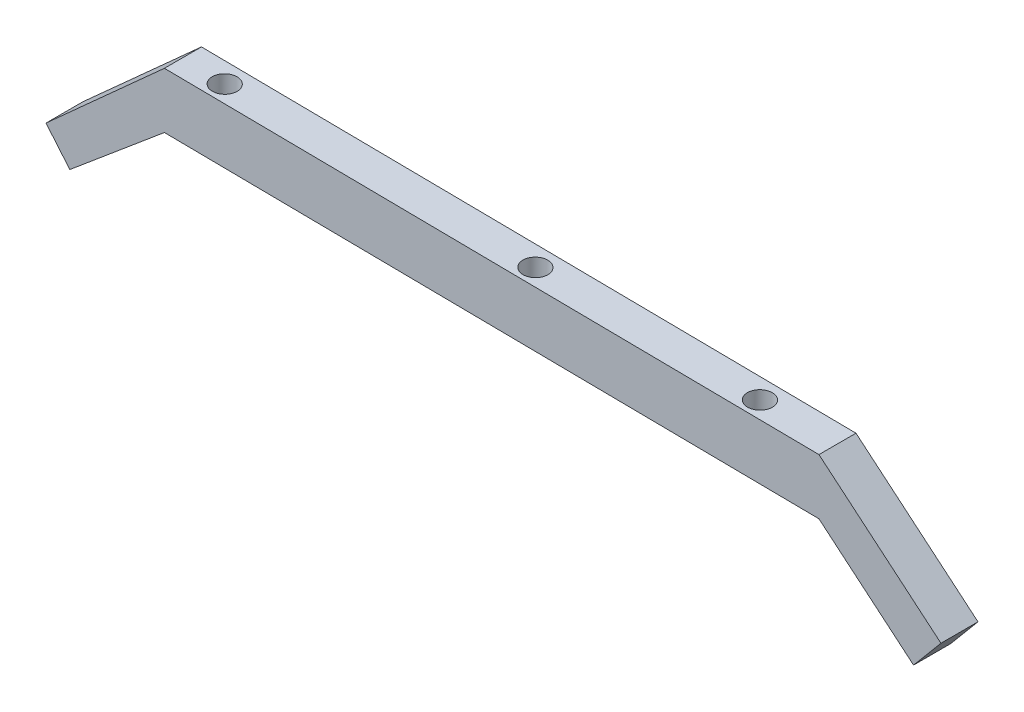
ISO-10303-21;
HEADER;
FILE_DESCRIPTION(('STEP AP214'),'2;1');
FILE_NAME('part.step','',(''),(''),'','','');
FILE_SCHEMA(('AUTOMOTIVE_DESIGN { 1 0 10303 214 1 1 1 1 }'));
ENDSEC;
DATA;
#1=APPLICATION_CONTEXT('core data for automotive mechanical design processes');
#2=APPLICATION_PROTOCOL_DEFINITION('international standard','automotive_design',2000,#1);
#3=PRODUCT_CONTEXT('',#1,'mechanical');
#4=PRODUCT('Part','Part','',(#3));
#5=PRODUCT_RELATED_PRODUCT_CATEGORY('part','',(#4));
#6=PRODUCT_DEFINITION_FORMATION('','',#4);
#7=PRODUCT_DEFINITION_CONTEXT('part definition',#1,'design');
#8=PRODUCT_DEFINITION('design','',#6,#7);
#9=PRODUCT_DEFINITION_SHAPE('','',#8);
#10=(LENGTH_UNIT() NAMED_UNIT(*) SI_UNIT(.MILLI.,.METRE.));
#11=(NAMED_UNIT(*) PLANE_ANGLE_UNIT() SI_UNIT($,.RADIAN.));
#12=(NAMED_UNIT(*) SI_UNIT($,.STERADIAN.) SOLID_ANGLE_UNIT());
#13=UNCERTAINTY_MEASURE_WITH_UNIT(LENGTH_MEASURE(1.E-05),#10,'distance_accuracy_value','');
#14=(GEOMETRIC_REPRESENTATION_CONTEXT(3) GLOBAL_UNCERTAINTY_ASSIGNED_CONTEXT((#13)) GLOBAL_UNIT_ASSIGNED_CONTEXT((#10,
#11,#12)) REPRESENTATION_CONTEXT('',''));
#15=CARTESIAN_POINT('',(0.,0.,0.));
#16=DIRECTION('',(0.,0.,1.));
#17=DIRECTION('',(1.,0.,0.));
#18=AXIS2_PLACEMENT_3D('',#15,#16,#17);
#19=CARTESIAN_POINT('',(-57.2334537938202,-0.0976513037543366,6.));
#20=DIRECTION('',(-0.642787609686535,0.766044443118982,0.));
#21=DIRECTION('',(-0.766044443118982,-0.642787609686535,0.));
#22=AXIS2_PLACEMENT_3D('',#19,#20,#21);
#23=PLANE('',#22);
#24=DIRECTION('',(0.766044443118982,0.642787609686535,0.));
#25=VECTOR('',#24,1.);
#26=CARTESIAN_POINT('',(-57.2334537938202,-0.0976513037543366,0.));
#27=LINE('',#26,#25);
#28=CARTESIAN_POINT('',(-72.5543426561998,-12.953403497485,0.));
#29=VERTEX_POINT('',#28);
#30=CARTESIAN_POINT('',(-57.2334537938202,-0.0976513037543366,0.));
#31=VERTEX_POINT('',#30);
#32=EDGE_CURVE('E140',#29,#31,#27,.T.);
#33=ORIENTED_EDGE('',*,*,#32,.T.);
#34=DIRECTION('',(0.,0.,-1.));
#35=VECTOR('',#34,1.);
#36=CARTESIAN_POINT('',(-57.2334537938202,-0.0976513037543366,6.));
#37=LINE('',#36,#35);
#38=CARTESIAN_POINT('',(-57.2334537938202,-0.0976513037543366,6.));
#39=VERTEX_POINT('',#38);
#40=EDGE_CURVE('E11',#39,#31,#37,.T.);
#41=ORIENTED_EDGE('',*,*,#40,.F.);
#42=DIRECTION('',(0.766044443118982,0.642787609686535,0.));
#43=VECTOR('',#42,1.);
#44=CARTESIAN_POINT('',(-57.2334537938202,-0.0976513037543366,6.));
#45=LINE('',#44,#43);
#46=CARTESIAN_POINT('',(-72.5543426561998,-12.953403497485,6.));
#47=VERTEX_POINT('',#46);
#48=EDGE_CURVE('E163',#47,#39,#45,.T.);
#49=ORIENTED_EDGE('',*,*,#48,.F.);
#50=DIRECTION('',(0.,0.,-1.));
#51=VECTOR('',#50,1.);
#52=CARTESIAN_POINT('',(-72.5543426561998,-12.953403497485,6.));
#53=LINE('',#52,#51);
#54=EDGE_CURVE('E136',#47,#29,#53,.T.);
#55=ORIENTED_EDGE('',*,*,#54,.T.);
#56=EDGE_LOOP('',(#33,#41,#49,#55));
#57=FACE_BOUND('',#56,.T.);
#58=ADVANCED_FACE('F39',(#57),#23,.F.);
#59=CARTESIAN_POINT('',(-57.2334537938202,-0.0976513037543366,6.));
#60=DIRECTION('',(0.0111065362275371,0.999938320524334,0.));
#61=DIRECTION('',(-0.999938320524335,0.0111065362275371,0.));
#62=AXIS2_PLACEMENT_3D('',#59,#60,#61);
#63=PLANE('',#62);
#64=CARTESIAN_POINT('',(-50.3211569221775,-0.174427714903513,3.2487874574399));
#65=DIRECTION('',(0.0111065362275371,0.999938320524334,0.));
#66=DIRECTION('',(-0.999938320524335,0.0111065362275371,0.));
#67=AXIS2_PLACEMENT_3D('',#64,#65,#66);
#68=CIRCLE('',#67,2.01708846596119);
#69=CARTESIAN_POINT('',(-52.3381209751798,-0.152024848782167,3.2487874574399));
#70=VERTEX_POINT('',#69);
#71=EDGE_CURVE('E145',#70,#70,#68,.T.);
#72=ORIENTED_EDGE('',*,*,#71,.T.);
#73=EDGE_LOOP('',(#72));
#74=FACE_BOUND('',#73,.T.);
#75=CARTESIAN_POINT('',(36.3606542700828,-1.13722177581173,3.2487874574399));
#76=DIRECTION('',(0.0111065362275371,0.999938320524334,0.));
#77=DIRECTION('',(-0.999938320524335,0.0111065362275371,0.));
#78=AXIS2_PLACEMENT_3D('',#75,#76,#77);
#79=CIRCLE('',#78,2.01708846596119);
#80=CARTESIAN_POINT('',(34.3436902170805,-1.11481890969039,3.2487874574399));
#81=VERTEX_POINT('',#80);
#82=EDGE_CURVE('E210',#81,#81,#79,.T.);
#83=ORIENTED_EDGE('',*,*,#82,.T.);
#84=EDGE_LOOP('',(#83));
#85=FACE_BOUND('',#84,.T.);
#86=CARTESIAN_POINT('',(-0.00814454195178721,-0.733265478441249,3.2487874574399));
#87=DIRECTION('',(0.0111065362275371,0.999938320524334,0.));
#88=DIRECTION('',(-0.999938320524335,0.0111065362275371,0.));
#89=AXIS2_PLACEMENT_3D('',#86,#87,#88);
#90=CIRCLE('',#89,2.01708846596119);
#91=CARTESIAN_POINT('',(-2.02510859495402,-0.710862612319903,3.2487874574399));
#92=VERTEX_POINT('',#91);
#93=EDGE_CURVE('E214',#92,#92,#90,.T.);
#94=ORIENTED_EDGE('',*,*,#93,.T.);
#95=EDGE_LOOP('',(#94));
#96=FACE_BOUND('',#95,.T.);
#97=DIRECTION('',(0.999938320524334,-0.0111065362275371,0.));
#98=VECTOR('',#97,1.);
#99=CARTESIAN_POINT('',(-57.2334537938202,-0.0976513037543366,0.));
#100=LINE('',#99,#98);
#101=CARTESIAN_POINT('',(48.7665462061798,-1.27501676315748,0.));
#102=VERTEX_POINT('',#101);
#103=EDGE_CURVE('E144',#31,#102,#100,.T.);
#104=ORIENTED_EDGE('',*,*,#103,.T.);
#105=DIRECTION('',(0.,0.,-1.));
#106=VECTOR('',#105,1.);
#107=CARTESIAN_POINT('',(48.7665462061798,-1.27501676315748,6.));
#108=LINE('',#107,#106);
#109=CARTESIAN_POINT('',(48.7665462061798,-1.27501676315748,6.));
#110=VERTEX_POINT('',#109);
#111=EDGE_CURVE('E48',#110,#102,#108,.T.);
#112=ORIENTED_EDGE('',*,*,#111,.F.);
#113=DIRECTION('',(0.999938320524334,-0.0111065362275371,0.));
#114=VECTOR('',#113,1.);
#115=CARTESIAN_POINT('',(-57.2334537938202,-0.0976513037543366,6.));
#116=LINE('',#115,#114);
#117=EDGE_CURVE('E99',#39,#110,#116,.T.);
#118=ORIENTED_EDGE('',*,*,#117,.F.);
#119=ORIENTED_EDGE('',*,*,#40,.T.);
#120=EDGE_LOOP('',(#104,#112,#118,#119));
#121=FACE_BOUND('',#120,.T.);
#122=ADVANCED_FACE('F246',(#74,#85,#96,#121),#63,.F.);
#123=CARTESIAN_POINT('',(48.7665462061798,-1.27501676315748,6.));
#124=DIRECTION('',(0.642787609686538,0.766044443118979,0.));
#125=DIRECTION('',(-0.766044443118979,0.642787609686538,0.));
#126=AXIS2_PLACEMENT_3D('',#123,#124,#125);
#127=PLANE('',#126);
#128=DIRECTION('',(0.766044443118979,-0.642787609686538,0.));
#129=VECTOR('',#128,1.);
#130=CARTESIAN_POINT('',(48.7665462061798,-1.27501676315748,0.));
#131=LINE('',#130,#129);
#132=CARTESIAN_POINT('',(64.0874350685594,-14.1307689568883,0.));
#133=VERTEX_POINT('',#132);
#134=EDGE_CURVE('E148',#102,#133,#131,.T.);
#135=ORIENTED_EDGE('',*,*,#134,.T.);
#136=DIRECTION('',(0.,0.,-1.));
#137=VECTOR('',#136,1.);
#138=CARTESIAN_POINT('',(64.0874350685594,-14.1307689568883,6.));
#139=LINE('',#138,#137);
#140=CARTESIAN_POINT('',(64.0874350685594,-14.1307689568883,6.));
#141=VERTEX_POINT('',#140);
#142=EDGE_CURVE('E174',#141,#133,#139,.T.);
#143=ORIENTED_EDGE('',*,*,#142,.F.);
#144=DIRECTION('',(0.766044443118979,-0.642787609686538,0.));
#145=VECTOR('',#144,1.);
#146=CARTESIAN_POINT('',(48.7665462061798,-1.27501676315748,6.));
#147=LINE('',#146,#145);
#148=EDGE_CURVE('E184',#110,#141,#147,.T.);
#149=ORIENTED_EDGE('',*,*,#148,.F.);
#150=ORIENTED_EDGE('',*,*,#111,.T.);
#151=EDGE_LOOP('',(#135,#143,#149,#150));
#152=FACE_BOUND('',#151,.T.);
#153=ADVANCED_FACE('F182',(#152),#127,.F.);
#154=CARTESIAN_POINT('',(64.0874350685594,-14.1307689568883,6.));
#155=DIRECTION('',(-0.766044443118979,0.642787609686538,0.));
#156=DIRECTION('',(-0.642787609686538,-0.766044443118979,0.));
#157=AXIS2_PLACEMENT_3D('',#154,#155,#156);
#158=PLANE('',#157);
#159=DIRECTION('',(0.642787609686538,0.766044443118979,0.));
#160=VECTOR('',#159,1.);
#161=CARTESIAN_POINT('',(64.0874350685594,-14.1307689568883,0.));
#162=LINE('',#161,#160);
#163=CARTESIAN_POINT('',(68.5239000429531,-8.84359588523619,0.));
#164=VERTEX_POINT('',#163);
#165=EDGE_CURVE('E151',#133,#164,#162,.T.);
#166=ORIENTED_EDGE('',*,*,#165,.T.);
#167=DIRECTION('',(0.,0.,-1.));
#168=VECTOR('',#167,1.);
#169=CARTESIAN_POINT('',(68.5239000429531,-8.84359588523619,6.));
#170=LINE('',#169,#168);
#171=CARTESIAN_POINT('',(68.5239000429531,-8.84359588523619,6.));
#172=VERTEX_POINT('',#171);
#173=EDGE_CURVE('E170',#172,#164,#170,.T.);
#174=ORIENTED_EDGE('',*,*,#173,.F.);
#175=DIRECTION('',(0.642787609686538,0.766044443118979,0.));
#176=VECTOR('',#175,1.);
#177=CARTESIAN_POINT('',(64.0874350685594,-14.1307689568883,6.));
#178=LINE('',#177,#176);
#179=EDGE_CURVE('E197',#141,#172,#178,.T.);
#180=ORIENTED_EDGE('',*,*,#179,.F.);
#181=ORIENTED_EDGE('',*,*,#142,.T.);
#182=EDGE_LOOP('',(#166,#174,#180,#181));
#183=FACE_BOUND('',#182,.T.);
#184=ADVANCED_FACE('F192',(#183),#158,.F.);
#185=CARTESIAN_POINT('',(48.7665462061798,7.73479243223928,6.));
#186=DIRECTION('',(-0.642787609686539,-0.766044443118978,0.));
#187=DIRECTION('',(0.766044443118978,-0.642787609686539,0.));
#188=AXIS2_PLACEMENT_3D('',#185,#186,#187);
#189=PLANE('',#188);
#190=DIRECTION('',(-0.766044443118978,0.642787609686539,0.));
#191=VECTOR('',#190,1.);
#192=CARTESIAN_POINT('',(48.7665462061798,7.73479243223928,0.));
#193=LINE('',#192,#191);
#194=CARTESIAN_POINT('',(48.7665462061798,7.73479243223928,0.));
#195=VERTEX_POINT('',#194);
#196=EDGE_CURVE('E154',#164,#195,#193,.T.);
#197=ORIENTED_EDGE('',*,*,#196,.T.);
#198=DIRECTION('',(0.,0.,-1.));
#199=VECTOR('',#198,1.);
#200=CARTESIAN_POINT('',(48.7665462061798,7.73479243223928,6.));
#201=LINE('',#200,#199);
#202=CARTESIAN_POINT('',(48.7665462061798,7.73479243223928,6.));
#203=VERTEX_POINT('',#202);
#204=EDGE_CURVE('E129',#203,#195,#201,.T.);
#205=ORIENTED_EDGE('',*,*,#204,.F.);
#206=DIRECTION('',(-0.766044443118978,0.642787609686539,0.));
#207=VECTOR('',#206,1.);
#208=CARTESIAN_POINT('',(48.7665462061798,7.73479243223928,6.));
#209=LINE('',#208,#207);
#210=EDGE_CURVE('E118',#172,#203,#209,.T.);
#211=ORIENTED_EDGE('',*,*,#210,.F.);
#212=ORIENTED_EDGE('',*,*,#173,.T.);
#213=EDGE_LOOP('',(#197,#205,#211,#212));
#214=FACE_BOUND('',#213,.T.);
#215=ADVANCED_FACE('F195',(#214),#189,.F.);
#216=CARTESIAN_POINT('',(-57.2334537938202,8.91215789164242,6.));
#217=DIRECTION('',(-0.0111065362275371,-0.999938320524334,0.));
#218=DIRECTION('',(0.999938320524335,-0.0111065362275371,0.));
#219=AXIS2_PLACEMENT_3D('',#216,#217,#218);
#220=PLANE('',#219);
#221=CARTESIAN_POINT('',(-50.2210953220734,8.83427007415574,3.2487874574399));
#222=DIRECTION('',(0.0111065362275371,0.999938320524334,0.));
#223=DIRECTION('',(-0.999938320524335,0.0111065362275371,0.));
#224=AXIS2_PLACEMENT_3D('',#221,#222,#223);
#225=CIRCLE('',#224,2.01708846596119);
#226=CARTESIAN_POINT('',(-52.2380593750756,8.85667294027708,3.2487874574399));
#227=VERTEX_POINT('',#226);
#228=EDGE_CURVE('E223',#227,#227,#225,.T.);
#229=ORIENTED_EDGE('',*,*,#228,.F.);
#230=EDGE_LOOP('',(#229));
#231=FACE_BOUND('',#230,.T.);
#232=CARTESIAN_POINT('',(36.4607158701869,7.87147601324752,3.2487874574399));
#233=DIRECTION('',(0.0111065362275371,0.999938320524334,0.));
#234=DIRECTION('',(-0.999938320524335,0.0111065362275371,0.));
#235=AXIS2_PLACEMENT_3D('',#232,#233,#234);
#236=CIRCLE('',#235,2.01708846596119);
#237=CARTESIAN_POINT('',(34.4437518171847,7.89387887936886,3.2487874574399));
#238=VERTEX_POINT('',#237);
#239=EDGE_CURVE('E222',#238,#238,#236,.T.);
#240=ORIENTED_EDGE('',*,*,#239,.F.);
#241=EDGE_LOOP('',(#240));
#242=FACE_BOUND('',#241,.T.);
#243=CARTESIAN_POINT('',(0.0919170581523617,8.275432310618,3.2487874574399));
#244=DIRECTION('',(0.0111065362275371,0.999938320524334,0.));
#245=DIRECTION('',(-0.999938320524335,0.0111065362275371,0.));
#246=AXIS2_PLACEMENT_3D('',#243,#244,#245);
#247=CIRCLE('',#246,2.01708846596119);
#248=CARTESIAN_POINT('',(-1.92504699484988,8.29783517673935,3.2487874574399));
#249=VERTEX_POINT('',#248);
#250=EDGE_CURVE('E218',#249,#249,#247,.T.);
#251=ORIENTED_EDGE('',*,*,#250,.F.);
#252=EDGE_LOOP('',(#251));
#253=FACE_BOUND('',#252,.T.);
#254=DIRECTION('',(-0.999938320524334,0.0111065362275371,0.));
#255=VECTOR('',#254,1.);
#256=CARTESIAN_POINT('',(-57.2334537938202,8.91215789164242,0.));
#257=LINE('',#256,#255);
#258=CARTESIAN_POINT('',(-57.2334537938202,8.91215789164242,0.));
#259=VERTEX_POINT('',#258);
#260=EDGE_CURVE('E127',#195,#259,#257,.T.);
#261=ORIENTED_EDGE('',*,*,#260,.T.);
#262=DIRECTION('',(0.,0.,-1.));
#263=VECTOR('',#262,1.);
#264=CARTESIAN_POINT('',(-57.2334537938202,8.91215789164242,6.));
#265=LINE('',#264,#263);
#266=CARTESIAN_POINT('',(-57.2334537938202,8.91215789164242,6.));
#267=VERTEX_POINT('',#266);
#268=EDGE_CURVE('E124',#267,#259,#265,.T.);
#269=ORIENTED_EDGE('',*,*,#268,.F.);
#270=DIRECTION('',(-0.999938320524334,0.0111065362275371,0.));
#271=VECTOR('',#270,1.);
#272=CARTESIAN_POINT('',(-57.2334537938202,8.91215789164242,6.));
#273=LINE('',#272,#271);
#274=EDGE_CURVE('E112',#203,#267,#273,.T.);
#275=ORIENTED_EDGE('',*,*,#274,.F.);
#276=ORIENTED_EDGE('',*,*,#204,.T.);
#277=EDGE_LOOP('',(#261,#269,#275,#276));
#278=FACE_BOUND('',#277,.T.);
#279=ADVANCED_FACE('F125',(#231,#242,#253,#278),#220,.F.);
#280=CARTESIAN_POINT('',(-76.411068314319,-8.35713683877114,6.));
#281=DIRECTION('',(0.669166836377617,-0.743112202222768,0.));
#282=DIRECTION('',(0.743112202222768,0.669166836377617,0.));
#283=AXIS2_PLACEMENT_3D('',#280,#281,#282);
#284=PLANE('',#283);
#285=DIRECTION('',(-0.743112202222768,-0.669166836377617,0.));
#286=VECTOR('',#285,1.);
#287=CARTESIAN_POINT('',(-76.411068314319,-8.35713683877114,0.));
#288=LINE('',#287,#286);
#289=CARTESIAN_POINT('',(-76.411068314319,-8.35713683877114,0.));
#290=VERTEX_POINT('',#289);
#291=EDGE_CURVE('E85',#259,#290,#288,.T.);
#292=ORIENTED_EDGE('',*,*,#291,.T.);
#293=DIRECTION('',(0.,0.,-1.));
#294=VECTOR('',#293,1.);
#295=CARTESIAN_POINT('',(-76.411068314319,-8.35713683877114,6.));
#296=LINE('',#295,#294);
#297=CARTESIAN_POINT('',(-76.411068314319,-8.35713683877114,6.));
#298=VERTEX_POINT('',#297);
#299=EDGE_CURVE('E130',#298,#290,#296,.T.);
#300=ORIENTED_EDGE('',*,*,#299,.F.);
#301=DIRECTION('',(-0.743112202222768,-0.669166836377617,0.));
#302=VECTOR('',#301,1.);
#303=CARTESIAN_POINT('',(-76.411068314319,-8.35713683877114,6.));
#304=LINE('',#303,#302);
#305=EDGE_CURVE('E116',#267,#298,#304,.T.);
#306=ORIENTED_EDGE('',*,*,#305,.F.);
#307=ORIENTED_EDGE('',*,*,#268,.T.);
#308=EDGE_LOOP('',(#292,#300,#306,#307));
#309=FACE_BOUND('',#308,.T.);
#310=ADVANCED_FACE('F132',(#309),#284,.F.);
#311=CARTESIAN_POINT('',(-72.5543426561998,-12.953403497485,6.));
#312=DIRECTION('',(0.766044443118982,0.642787609686534,0.));
#313=DIRECTION('',(-0.642787609686534,0.766044443118983,0.));
#314=AXIS2_PLACEMENT_3D('',#311,#312,#313);
#315=PLANE('',#314);
#316=DIRECTION('',(0.642787609686534,-0.766044443118982,0.));
#317=VECTOR('',#316,1.);
#318=CARTESIAN_POINT('',(-72.5543426561998,-12.953403497485,0.));
#319=LINE('',#318,#317);
#320=EDGE_CURVE('E91',#290,#29,#319,.T.);
#321=ORIENTED_EDGE('',*,*,#320,.T.);
#322=ORIENTED_EDGE('',*,*,#54,.F.);
#323=DIRECTION('',(0.642787609686534,-0.766044443118982,0.));
#324=VECTOR('',#323,1.);
#325=CARTESIAN_POINT('',(-72.5543426561998,-12.953403497485,6.));
#326=LINE('',#325,#324);
#327=EDGE_CURVE('E56',#298,#47,#326,.T.);
#328=ORIENTED_EDGE('',*,*,#327,.F.);
#329=ORIENTED_EDGE('',*,*,#299,.T.);
#330=EDGE_LOOP('',(#321,#322,#328,#329));
#331=FACE_BOUND('',#330,.T.);
#332=ADVANCED_FACE('F252',(#331),#315,.F.);
#333=CARTESIAN_POINT('',(0.,0.,6.));
#334=DIRECTION('',(0.,0.,-1.));
#335=DIRECTION('',(-1.,0.,0.));
#336=AXIS2_PLACEMENT_3D('',#333,#334,#335);
#337=PLANE('',#336);
#338=ORIENTED_EDGE('',*,*,#48,.T.);
#339=ORIENTED_EDGE('',*,*,#117,.T.);
#340=ORIENTED_EDGE('',*,*,#148,.T.);
#341=ORIENTED_EDGE('',*,*,#179,.T.);
#342=ORIENTED_EDGE('',*,*,#210,.T.);
#343=ORIENTED_EDGE('',*,*,#274,.T.);
#344=ORIENTED_EDGE('',*,*,#305,.T.);
#345=ORIENTED_EDGE('',*,*,#327,.T.);
#346=EDGE_LOOP('',(#338,#339,#340,#341,#342,#343,#344,#345));
#347=FACE_BOUND('',#346,.T.);
#348=ADVANCED_FACE('F114',(#347),#337,.F.);
#349=CARTESIAN_POINT('',(0.,0.,0.));
#350=DIRECTION('',(0.,0.,-1.));
#351=DIRECTION('',(-1.,0.,0.));
#352=AXIS2_PLACEMENT_3D('',#349,#350,#351);
#353=PLANE('',#352);
#354=ORIENTED_EDGE('',*,*,#32,.F.);
#355=ORIENTED_EDGE('',*,*,#320,.F.);
#356=ORIENTED_EDGE('',*,*,#291,.F.);
#357=ORIENTED_EDGE('',*,*,#260,.F.);
#358=ORIENTED_EDGE('',*,*,#196,.F.);
#359=ORIENTED_EDGE('',*,*,#165,.F.);
#360=ORIENTED_EDGE('',*,*,#134,.F.);
#361=ORIENTED_EDGE('',*,*,#103,.F.);
#362=EDGE_LOOP('',(#354,#355,#356,#357,#358,#359,#360,#361));
#363=FACE_BOUND('',#362,.T.);
#364=ADVANCED_FACE('F188',(#363),#353,.T.);
#365=CARTESIAN_POINT('',(-0.185746347536067,-16.7230257024904,3.2487874574399));
#366=DIRECTION('',(0.0111065362275371,0.999938320524334,0.));
#367=DIRECTION('',(-0.999938320524334,0.0111065362275371,0.));
#368=AXIS2_PLACEMENT_3D('',#365,#366,#367);
#369=CYLINDRICAL_SURFACE('',#368,2.01708846596119);
#370=ORIENTED_EDGE('',*,*,#250,.T.);
#371=EDGE_LOOP('',(#370));
#372=FACE_BOUND('',#371,.T.);
#373=ORIENTED_EDGE('',*,*,#93,.F.);
#374=EDGE_LOOP('',(#373));
#375=FACE_BOUND('',#374,.T.);
#376=ADVANCED_FACE('F240',(#372,#375),#369,.F.);
#377=CARTESIAN_POINT('',(36.1830524644985,-17.1269819998608,3.2487874574399));
#378=DIRECTION('',(0.0111065362275371,0.999938320524334,0.));
#379=DIRECTION('',(-0.999938320524334,0.0111065362275371,0.));
#380=AXIS2_PLACEMENT_3D('',#377,#378,#379);
#381=CYLINDRICAL_SURFACE('',#380,2.01708846596119);
#382=ORIENTED_EDGE('',*,*,#239,.T.);
#383=EDGE_LOOP('',(#382));
#384=FACE_BOUND('',#383,.T.);
#385=ORIENTED_EDGE('',*,*,#82,.F.);
#386=EDGE_LOOP('',(#385));
#387=FACE_BOUND('',#386,.T.);
#388=ADVANCED_FACE('F231',(#384,#387),#381,.F.);
#389=CARTESIAN_POINT('',(-50.4987587277618,-16.1641879389526,3.2487874574399));
#390=DIRECTION('',(0.0111065362275371,0.999938320524334,0.));
#391=DIRECTION('',(-0.999938320524334,0.0111065362275371,0.));
#392=AXIS2_PLACEMENT_3D('',#389,#390,#391);
#393=CYLINDRICAL_SURFACE('',#392,2.01708846596119);
#394=ORIENTED_EDGE('',*,*,#228,.T.);
#395=EDGE_LOOP('',(#394));
#396=FACE_BOUND('',#395,.T.);
#397=ORIENTED_EDGE('',*,*,#71,.F.);
#398=EDGE_LOOP('',(#397));
#399=FACE_BOUND('',#398,.T.);
#400=ADVANCED_FACE('F324',(#396,#399),#393,.F.);
#401=CLOSED_SHELL('',(#58,#122,#153,#184,#215,#279,#310,#332,#348,#364,#376,#388,#400));
#402=MANIFOLD_SOLID_BREP('B2',#401);
#403=ADVANCED_BREP_SHAPE_REPRESENTATION('',(#18,#402),#14);
#404=SHAPE_DEFINITION_REPRESENTATION(#9,#403);
ENDSEC;
END-ISO-10303-21;
